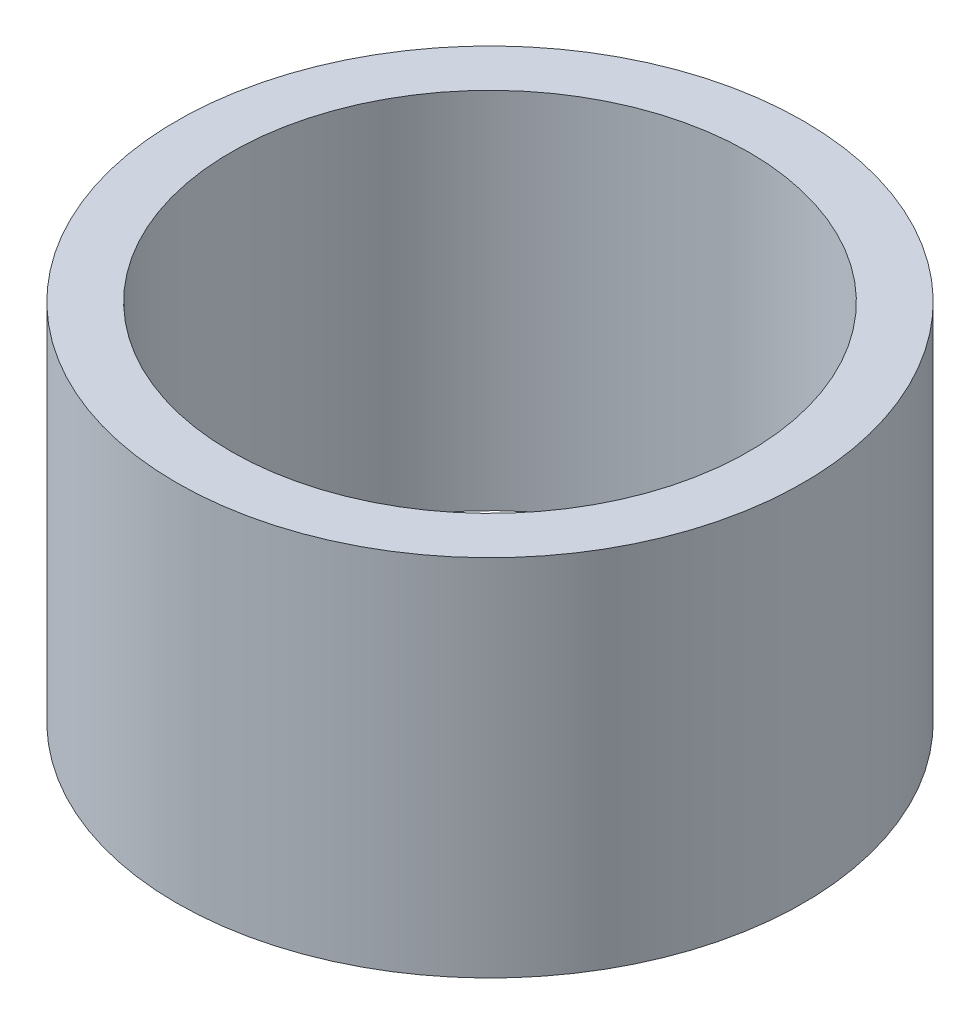
ISO-10303-21;
HEADER;
FILE_DESCRIPTION(('STEP AP214'),'2;1');
FILE_NAME('part.step','',(''),(''),'','','');
FILE_SCHEMA(('AUTOMOTIVE_DESIGN { 1 0 10303 214 1 1 1 1 }'));
ENDSEC;
DATA;
#1=APPLICATION_CONTEXT('core data for automotive mechanical design processes');
#2=APPLICATION_PROTOCOL_DEFINITION('international standard','automotive_design',2000,#1);
#3=PRODUCT_CONTEXT('',#1,'mechanical');
#4=PRODUCT('Part','Part','',(#3));
#5=PRODUCT_RELATED_PRODUCT_CATEGORY('part','',(#4));
#6=PRODUCT_DEFINITION_FORMATION('','',#4);
#7=PRODUCT_DEFINITION_CONTEXT('part definition',#1,'design');
#8=PRODUCT_DEFINITION('design','',#6,#7);
#9=PRODUCT_DEFINITION_SHAPE('','',#8);
#10=(LENGTH_UNIT() NAMED_UNIT(*) SI_UNIT(.MILLI.,.METRE.));
#11=(NAMED_UNIT(*) PLANE_ANGLE_UNIT() SI_UNIT($,.RADIAN.));
#12=(NAMED_UNIT(*) SI_UNIT($,.STERADIAN.) SOLID_ANGLE_UNIT());
#13=UNCERTAINTY_MEASURE_WITH_UNIT(LENGTH_MEASURE(1.E-05),#10,'distance_accuracy_value','');
#14=(GEOMETRIC_REPRESENTATION_CONTEXT(3) GLOBAL_UNCERTAINTY_ASSIGNED_CONTEXT((#13)) GLOBAL_UNIT_ASSIGNED_CONTEXT((#10,
#11,#12)) REPRESENTATION_CONTEXT('',''));
#15=CARTESIAN_POINT('',(0.,0.,0.));
#16=DIRECTION('',(0.,0.,1.));
#17=DIRECTION('',(1.,0.,0.));
#18=AXIS2_PLACEMENT_3D('',#15,#16,#17);
#19=CARTESIAN_POINT('',(0.,31.9412074751483,0.));
#20=DIRECTION('',(0.,-1.,0.));
#21=DIRECTION('',(0.,0.,-1.));
#22=AXIS2_PLACEMENT_3D('',#19,#20,#21);
#23=CYLINDRICAL_SURFACE('',#22,27.5);
#24=CARTESIAN_POINT('',(0.,31.9412074751483,0.));
#25=DIRECTION('',(0.,1.,0.));
#26=DIRECTION('',(0.,0.,1.));
#27=AXIS2_PLACEMENT_3D('',#24,#25,#26);
#28=CIRCLE('',#27,27.5);
#29=CARTESIAN_POINT('',(0.,31.9412074751483,27.5));
#30=VERTEX_POINT('',#29);
#31=EDGE_CURVE('E10',#30,#30,#28,.T.);
#32=ORIENTED_EDGE('',*,*,#31,.F.);
#33=EDGE_LOOP('',(#32));
#34=FACE_BOUND('',#33,.T.);
#35=CARTESIAN_POINT('',(0.,0.,0.));
#36=DIRECTION('',(0.,1.,0.));
#37=DIRECTION('',(0.,0.,1.));
#38=AXIS2_PLACEMENT_3D('',#35,#36,#37);
#39=CIRCLE('',#38,27.5);
#40=CARTESIAN_POINT('',(0.,0.,27.5));
#41=VERTEX_POINT('',#40);
#42=EDGE_CURVE('E37',#41,#41,#39,.T.);
#43=ORIENTED_EDGE('',*,*,#42,.T.);
#44=EDGE_LOOP('',(#43));
#45=FACE_BOUND('',#44,.T.);
#46=ADVANCED_FACE('F40',(#34,#45),#23,.T.);
#47=CARTESIAN_POINT('',(0.,31.9412074751483,0.));
#48=DIRECTION('',(0.,1.,0.));
#49=DIRECTION('',(0.,0.,1.));
#50=AXIS2_PLACEMENT_3D('',#47,#48,#49);
#51=PLANE('',#50);
#52=CARTESIAN_POINT('',(0.,31.9412074751483,0.));
#53=DIRECTION('',(0.,1.,0.));
#54=DIRECTION('',(0.,0.,1.));
#55=AXIS2_PLACEMENT_3D('',#52,#53,#54);
#56=CIRCLE('',#55,22.7331537212678);
#57=CARTESIAN_POINT('',(0.,31.9412074751483,22.7331537212678));
#58=VERTEX_POINT('',#57);
#59=EDGE_CURVE('E50',#58,#58,#56,.T.);
#60=ORIENTED_EDGE('',*,*,#59,.F.);
#61=EDGE_LOOP('',(#60));
#62=FACE_BOUND('',#61,.T.);
#63=ORIENTED_EDGE('',*,*,#31,.T.);
#64=EDGE_LOOP('',(#63));
#65=FACE_BOUND('',#64,.T.);
#66=ADVANCED_FACE('F59',(#62,#65),#51,.T.);
#67=CARTESIAN_POINT('',(0.,0.,0.));
#68=DIRECTION('',(0.,1.,0.));
#69=DIRECTION('',(0.,0.,1.));
#70=AXIS2_PLACEMENT_3D('',#67,#68,#69);
#71=PLANE('',#70);
#72=CARTESIAN_POINT('',(0.,0.,0.));
#73=DIRECTION('',(0.,1.,0.));
#74=DIRECTION('',(0.,0.,1.));
#75=AXIS2_PLACEMENT_3D('',#72,#73,#74);
#76=CIRCLE('',#75,22.7331537212678);
#77=CARTESIAN_POINT('',(0.,0.,22.7331537212678));
#78=VERTEX_POINT('',#77);
#79=EDGE_CURVE('E47',#78,#78,#76,.T.);
#80=ORIENTED_EDGE('',*,*,#79,.T.);
#81=EDGE_LOOP('',(#80));
#82=FACE_BOUND('',#81,.T.);
#83=ORIENTED_EDGE('',*,*,#42,.F.);
#84=EDGE_LOOP('',(#83));
#85=FACE_BOUND('',#84,.T.);
#86=ADVANCED_FACE('F58',(#82,#85),#71,.F.);
#87=CARTESIAN_POINT('',(0.,31.9412074751483,0.));
#88=DIRECTION('',(0.,-1.,0.));
#89=DIRECTION('',(0.,0.,-1.));
#90=AXIS2_PLACEMENT_3D('',#87,#88,#89);
#91=CYLINDRICAL_SURFACE('',#90,22.7331537212678);
#92=ORIENTED_EDGE('',*,*,#59,.T.);
#93=EDGE_LOOP('',(#92));
#94=FACE_BOUND('',#93,.T.);
#95=ORIENTED_EDGE('',*,*,#79,.F.);
#96=EDGE_LOOP('',(#95));
#97=FACE_BOUND('',#96,.T.);
#98=ADVANCED_FACE('F54',(#94,#97),#91,.F.);
#99=CLOSED_SHELL('',(#46,#66,#86,#98));
#100=MANIFOLD_SOLID_BREP('B2',#99);
#101=ADVANCED_BREP_SHAPE_REPRESENTATION('',(#18,#100),#14);
#102=SHAPE_DEFINITION_REPRESENTATION(#9,#101);
ENDSEC;
END-ISO-10303-21;
